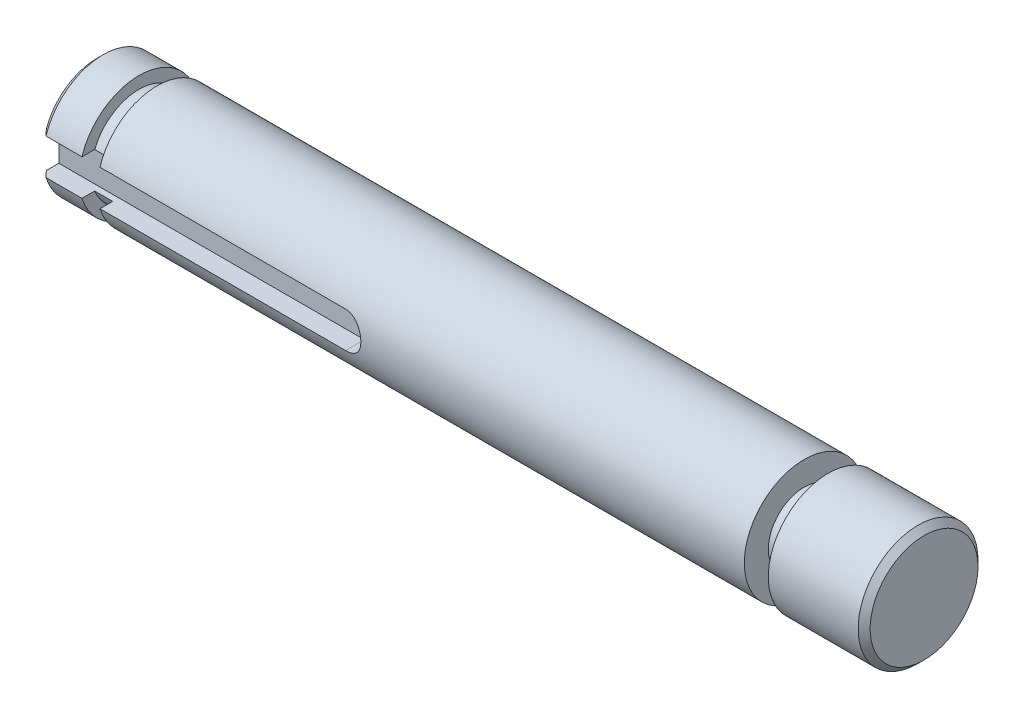
ISO-10303-21;
HEADER;
FILE_DESCRIPTION(('STEP AP214'),'2;1');
FILE_NAME('part.step','',(''),(''),'','','');
FILE_SCHEMA(('AUTOMOTIVE_DESIGN { 1 0 10303 214 1 1 1 1 }'));
ENDSEC;
DATA;
#1=APPLICATION_CONTEXT('core data for automotive mechanical design processes');
#2=APPLICATION_PROTOCOL_DEFINITION('international standard','automotive_design',2000,#1);
#3=PRODUCT_CONTEXT('',#1,'mechanical');
#4=PRODUCT('Part','Part','',(#3));
#5=PRODUCT_RELATED_PRODUCT_CATEGORY('part','',(#4));
#6=PRODUCT_DEFINITION_FORMATION('','',#4);
#7=PRODUCT_DEFINITION_CONTEXT('part definition',#1,'design');
#8=PRODUCT_DEFINITION('design','',#6,#7);
#9=PRODUCT_DEFINITION_SHAPE('','',#8);
#10=(LENGTH_UNIT() NAMED_UNIT(*) SI_UNIT(.MILLI.,.METRE.));
#11=(NAMED_UNIT(*) PLANE_ANGLE_UNIT() SI_UNIT($,.RADIAN.));
#12=(NAMED_UNIT(*) SI_UNIT($,.STERADIAN.) SOLID_ANGLE_UNIT());
#13=UNCERTAINTY_MEASURE_WITH_UNIT(LENGTH_MEASURE(1.E-05),#10,'distance_accuracy_value','');
#14=(GEOMETRIC_REPRESENTATION_CONTEXT(3) GLOBAL_UNCERTAINTY_ASSIGNED_CONTEXT((#13)) GLOBAL_UNIT_ASSIGNED_CONTEXT((#10,
#11,#12)) REPRESENTATION_CONTEXT('',''));
#15=CARTESIAN_POINT('',(0.,0.,0.));
#16=DIRECTION('',(0.,0.,1.));
#17=DIRECTION('',(1.,0.,0.));
#18=AXIS2_PLACEMENT_3D('',#15,#16,#17);
#19=CARTESIAN_POINT('',(34.5,0.,0.));
#20=DIRECTION('',(-1.,0.,0.));
#21=DIRECTION('',(0.,0.,1.));
#22=AXIS2_PLACEMENT_3D('',#19,#20,#21);
#23=CYLINDRICAL_SURFACE('',#22,5.);
#24=CARTESIAN_POINT('',(24.5,0.,0.));
#25=DIRECTION('',(1.,0.,0.));
#26=DIRECTION('',(0.,0.,-1.));
#27=AXIS2_PLACEMENT_3D('',#24,#25,#26);
#28=CIRCLE('',#27,5.);
#29=CARTESIAN_POINT('',(24.5,0.,-5.));
#30=VERTEX_POINT('',#29);
#31=EDGE_CURVE('E183',#30,#30,#28,.T.);
#32=ORIENTED_EDGE('',*,*,#31,.F.);
#33=EDGE_LOOP('',(#32));
#34=FACE_BOUND('',#33,.T.);
#35=DIRECTION('',(-1.,0.,0.));
#36=VECTOR('',#35,1.);
#37=CARTESIAN_POINT('',(34.5,-1.5,4.76969600708473));
#38=LINE('',#37,#36);
#39=CARTESIAN_POINT('',(-29.5,-1.5,4.76969600708473));
#40=VERTEX_POINT('',#39);
#41=CARTESIAN_POINT('',(-9.00000000000001,-1.5,4.76969600708473));
#42=VERTEX_POINT('',#41);
#43=EDGE_CURVE('E165',#40,#42,#38,.F.);
#44=ORIENTED_EDGE('',*,*,#43,.F.);
#45=CARTESIAN_POINT('',(-29.5,0.,0.));
#46=DIRECTION('',(-1.,0.,0.));
#47=DIRECTION('',(0.,0.,1.));
#48=AXIS2_PLACEMENT_3D('',#45,#46,#47);
#49=CIRCLE('',#48,5.);
#50=CARTESIAN_POINT('',(-29.5,1.5,4.76969600708473));
#51=VERTEX_POINT('',#50);
#52=EDGE_CURVE('E171',#51,#40,#49,.T.);
#53=ORIENTED_EDGE('',*,*,#52,.F.);
#54=DIRECTION('',(-1.,0.,0.));
#55=VECTOR('',#54,1.);
#56=CARTESIAN_POINT('',(34.5,1.5,4.76969600708473));
#57=LINE('',#56,#55);
#58=CARTESIAN_POINT('',(-9.00000000000001,1.5,4.76969600708473));
#59=VERTEX_POINT('',#58);
#60=EDGE_CURVE('E156',#59,#51,#57,.T.);
#61=ORIENTED_EDGE('',*,*,#60,.F.);
#62=CARTESIAN_POINT('',(-9.00000000000001,-1.5,4.76969600708473));
#63=CARTESIAN_POINT('',(-8.95882060709199,-1.50000085357071,4.76969249084934));
#64=CARTESIAN_POINT('',(-8.91766195687388,-1.49830317083428,4.77022997000129));
#65=CARTESIAN_POINT('',(-8.83565883790444,-1.49153785660317,4.77235095109999));
#66=CARTESIAN_POINT('',(-8.79481430060511,-1.48647098275841,4.77393421787376));
#67=CARTESIAN_POINT('',(-8.67340945904534,-1.46630203689311,4.78018490618873));
#68=CARTESIAN_POINT('',(-8.59369360958363,-1.44623120413662,4.78635370384275));
#69=CARTESIAN_POINT('',(-8.43896442161414,-1.39353102315626,4.80195952113208));
#70=CARTESIAN_POINT('',(-8.36394944780192,-1.36090607068203,4.81139539670393));
#71=CARTESIAN_POINT('',(-8.22040331840241,-1.28407841117655,4.83246571212052));
#72=CARTESIAN_POINT('',(-8.15187520027157,-1.23987031651226,4.84410117434933));
#73=CARTESIAN_POINT('',(-8.02113394400295,-1.13964850658326,4.86866835244721));
#74=CARTESIAN_POINT('',(-7.95915633965661,-1.08333433465208,4.88162755412974));
#75=CARTESIAN_POINT('',(-7.84536441610004,-0.961138919873354,4.90714811559049));
#76=CARTESIAN_POINT('',(-7.79355181399695,-0.895256063916348,4.91970940785249));
#77=CARTESIAN_POINT('',(-7.70053622968151,-0.75410992131543,4.94333239727705));
#78=CARTESIAN_POINT('',(-7.65957481970205,-0.678680819336259,4.95435770971354));
#79=CARTESIAN_POINT('',(-7.59101158838185,-0.521621185505775,4.97334469846208));
#80=CARTESIAN_POINT('',(-7.56340632220573,-0.439992259012928,4.98130716463903));
#81=CARTESIAN_POINT('',(-7.52312020089796,-0.275324697874879,4.99307639935002));
#82=CARTESIAN_POINT('',(-7.51003514203026,-0.192393125294255,4.99699549276993));
#83=CARTESIAN_POINT('',(-7.49788265863674,-0.0254235719980831,5.00063202022426));
#84=CARTESIAN_POINT('',(-7.49881258029984,0.0586141962423611,5.00035024971471));
#85=CARTESIAN_POINT('',(-7.514392908759,0.222571599946016,4.99569602566267));
#86=CARTESIAN_POINT('',(-7.52860534497872,0.30253714546464,4.99145415509187));
#87=CARTESIAN_POINT('',(-7.56963163523811,0.458890052102024,4.9795151369998));
#88=CARTESIAN_POINT('',(-7.59644614945594,0.535277225531996,4.97181780846028));
#89=CARTESIAN_POINT('',(-7.66221222164644,0.683347815892215,4.95365214926145));
#90=CARTESIAN_POINT('',(-7.70130164435695,0.754966006044141,4.94315255692525));
#91=CARTESIAN_POINT('',(-7.79039859004832,0.890765529574419,4.92049624651755));
#92=CARTESIAN_POINT('',(-7.84040855947884,0.954945191614594,4.90833915735884));
#93=CARTESIAN_POINT('',(-7.95219198808351,1.07665450541275,4.88311673571409));
#94=CARTESIAN_POINT('',(-8.01434386376075,1.13383351478034,4.87003445449554));
#95=CARTESIAN_POINT('',(-8.14749742342792,1.23706769492487,4.84484215114658));
#96=CARTESIAN_POINT('',(-8.21850168036553,1.28311962013078,4.83273241337565));
#97=CARTESIAN_POINT('',(-8.36828092844929,1.36316407240863,4.81077228795653));
#98=CARTESIAN_POINT('',(-8.44712717959341,1.39703006341134,4.80094596245948));
#99=CARTESIAN_POINT('',(-8.60972450398175,1.45085886004699,4.78495663653201));
#100=CARTESIAN_POINT('',(-8.69346786071438,1.47084293218035,4.77878803475875));
#101=CARTESIAN_POINT('',(-8.81499488907019,1.4890120359008,4.77314032325006));
#102=CARTESIAN_POINT('',(-8.85189073417961,1.49313202989009,4.77185156275267));
#103=CARTESIAN_POINT('',(-8.92585147909953,1.49862355614854,4.77012928611782));
#104=CARTESIAN_POINT('',(-8.96291604966386,1.49999912968269,4.76969451246644));
#105=CARTESIAN_POINT('',(-9.00000000000001,1.5,4.76969600708473));
#106=B_SPLINE_CURVE_WITH_KNOTS('',3,(#62,#63,#64,#65,#66,#67,#68,#69,#70,#71,#72,#73,#74,#75,
#76,#77,#78,#79,#80,#81,#82,#83,#84,#85,#86,#87,#88,#89,#90,#91,#92,#93,#94,#95,#96,#97,#98,#99,
#100,#101,#102,#103,#104,#105),.UNSPECIFIED.,.F.,.F.,(4,2,2,2,2,2,2,2,2,2,2,2,2,2,2,2,2,2,2,2,2,
4),(0.,0.123459071219734,0.246890388853042,0.49291134961521,0.738846245884323,0.984895736828092,
1.23795510798803,1.49105719006936,1.74939356197455,2.00766326783256,2.25854751319802,
2.5093842528947,2.75223130012966,2.99509107067835,3.2407824256273,3.48652887757005,
3.74172568310981,3.99699683536777,4.25484698071527,4.51230123440207,4.62365084745808,
4.73483637253615),.UNSPECIFIED.);
#107=EDGE_CURVE('E11',#42,#59,#106,.T.);
#108=ORIENTED_EDGE('',*,*,#107,.F.);
#109=EDGE_LOOP('',(#44,#53,#61,#108));
#110=FACE_BOUND('',#109,.T.);
#111=ADVANCED_FACE('F41',(#34,#110),#23,.T.);
#112=CARTESIAN_POINT('',(-31.,0.,0.));
#113=DIRECTION('',(-1.,0.,0.));
#114=DIRECTION('',(0.,0.,1.));
#115=AXIS2_PLACEMENT_3D('',#112,#113,#114);
#116=PLANE('',#115);
#117=DIRECTION('',(0.,0.,-1.));
#118=VECTOR('',#117,1.);
#119=CARTESIAN_POINT('',(-31.,-1.5,0.));
#120=LINE('',#119,#118);
#121=CARTESIAN_POINT('',(-31.,-1.5,4.76969600708473));
#122=VERTEX_POINT('',#121);
#123=CARTESIAN_POINT('',(-31.,-1.5,3.70809924354783));
#124=VERTEX_POINT('',#123);
#125=EDGE_CURVE('E160',#122,#124,#120,.T.);
#126=ORIENTED_EDGE('',*,*,#125,.F.);
#127=CARTESIAN_POINT('',(-31.,0.,0.));
#128=DIRECTION('',(-1.,0.,0.));
#129=DIRECTION('',(0.,0.,1.));
#130=AXIS2_PLACEMENT_3D('',#127,#128,#129);
#131=CIRCLE('',#130,5.);
#132=CARTESIAN_POINT('',(-31.,1.5,4.76969600708473));
#133=VERTEX_POINT('',#132);
#134=EDGE_CURVE('E174',#133,#122,#131,.T.);
#135=ORIENTED_EDGE('',*,*,#134,.F.);
#136=DIRECTION('',(0.,0.,1.));
#137=VECTOR('',#136,1.);
#138=CARTESIAN_POINT('',(-31.,1.5,0.));
#139=LINE('',#138,#137);
#140=CARTESIAN_POINT('',(-31.,1.5,3.70809924354783));
#141=VERTEX_POINT('',#140);
#142=EDGE_CURVE('E144',#141,#133,#139,.T.);
#143=ORIENTED_EDGE('',*,*,#142,.F.);
#144=CARTESIAN_POINT('',(-31.,0.,0.));
#145=DIRECTION('',(-1.,0.,0.));
#146=DIRECTION('',(0.,0.,1.));
#147=AXIS2_PLACEMENT_3D('',#144,#145,#146);
#148=CIRCLE('',#147,4.);
#149=EDGE_CURVE('E168',#141,#124,#148,.T.);
#150=ORIENTED_EDGE('',*,*,#149,.T.);
#151=EDGE_LOOP('',(#126,#135,#143,#150));
#152=FACE_BOUND('',#151,.T.);
#153=ADVANCED_FACE('F229',(#152),#116,.F.);
#154=CARTESIAN_POINT('',(-29.5,0.,0.));
#155=DIRECTION('',(-1.,0.,0.));
#156=DIRECTION('',(0.,0.,1.));
#157=AXIS2_PLACEMENT_3D('',#154,#155,#156);
#158=PLANE('',#157);
#159=ORIENTED_EDGE('',*,*,#52,.T.);
#160=DIRECTION('',(0.,0.,-1.));
#161=VECTOR('',#160,1.);
#162=CARTESIAN_POINT('',(-29.5,-1.5,0.));
#163=LINE('',#162,#161);
#164=CARTESIAN_POINT('',(-29.5,-1.5,3.70809924354783));
#165=VERTEX_POINT('',#164);
#166=EDGE_CURVE('E71',#40,#165,#163,.T.);
#167=ORIENTED_EDGE('',*,*,#166,.T.);
#168=CARTESIAN_POINT('',(-29.5,0.,0.));
#169=DIRECTION('',(-1.,0.,0.));
#170=DIRECTION('',(0.,0.,1.));
#171=AXIS2_PLACEMENT_3D('',#168,#169,#170);
#172=CIRCLE('',#171,4.);
#173=CARTESIAN_POINT('',(-29.5,1.5,3.70809924354783));
#174=VERTEX_POINT('',#173);
#175=EDGE_CURVE('E167',#174,#165,#172,.T.);
#176=ORIENTED_EDGE('',*,*,#175,.F.);
#177=DIRECTION('',(0.,0.,1.));
#178=VECTOR('',#177,1.);
#179=CARTESIAN_POINT('',(-29.5,1.5,0.));
#180=LINE('',#179,#178);
#181=EDGE_CURVE('E153',#174,#51,#180,.T.);
#182=ORIENTED_EDGE('',*,*,#181,.T.);
#183=EDGE_LOOP('',(#159,#167,#176,#182));
#184=FACE_BOUND('',#183,.T.);
#185=ADVANCED_FACE('F227',(#184),#158,.T.);
#186=CARTESIAN_POINT('',(-31.,0.,0.));
#187=DIRECTION('',(1.,0.,0.));
#188=DIRECTION('',(0.,0.,-1.));
#189=AXIS2_PLACEMENT_3D('',#186,#187,#188);
#190=CYLINDRICAL_SURFACE('',#189,4.);
#191=DIRECTION('',(1.,0.,0.));
#192=VECTOR('',#191,1.);
#193=CARTESIAN_POINT('',(-31.,-1.5,3.70809924354783));
#194=LINE('',#193,#192);
#195=EDGE_CURVE('E162',#124,#165,#194,.T.);
#196=ORIENTED_EDGE('',*,*,#195,.F.);
#197=ORIENTED_EDGE('',*,*,#149,.F.);
#198=DIRECTION('',(1.,0.,0.));
#199=VECTOR('',#198,1.);
#200=CARTESIAN_POINT('',(-31.,1.5,3.70809924354783));
#201=LINE('',#200,#199);
#202=EDGE_CURVE('E151',#174,#141,#201,.F.);
#203=ORIENTED_EDGE('',*,*,#202,.F.);
#204=ORIENTED_EDGE('',*,*,#175,.T.);
#205=EDGE_LOOP('',(#196,#197,#203,#204));
#206=FACE_BOUND('',#205,.T.);
#207=ADVANCED_FACE('F224',(#206),#190,.T.);
#208=CARTESIAN_POINT('',(-34.5,0.,0.));
#209=DIRECTION('',(1.,0.,0.));
#210=DIRECTION('',(0.,0.,-1.));
#211=AXIS2_PLACEMENT_3D('',#208,#209,#210);
#212=PLANE('',#211);
#213=DIRECTION('',(0.,0.,-1.));
#214=VECTOR('',#213,1.);
#215=CARTESIAN_POINT('',(-34.5,-1.5,5.));
#216=LINE('',#215,#214);
#217=CARTESIAN_POINT('',(-34.5,-1.5,4.24264068711928));
#218=VERTEX_POINT('',#217);
#219=CARTESIAN_POINT('',(-34.5,-1.5,3.2));
#220=VERTEX_POINT('',#219);
#221=EDGE_CURVE('E121',#218,#220,#216,.T.);
#222=ORIENTED_EDGE('',*,*,#221,.T.);
#223=DIRECTION('',(0.,-1.,0.));
#224=VECTOR('',#223,1.);
#225=CARTESIAN_POINT('',(-34.5,1.5,3.2));
#226=LINE('',#225,#224);
#227=CARTESIAN_POINT('',(-34.5,1.5,3.2));
#228=VERTEX_POINT('',#227);
#229=EDGE_CURVE('E129',#228,#220,#226,.T.);
#230=ORIENTED_EDGE('',*,*,#229,.F.);
#231=DIRECTION('',(0.,0.,-1.));
#232=VECTOR('',#231,1.);
#233=CARTESIAN_POINT('',(-34.5,1.5,5.));
#234=LINE('',#233,#232);
#235=CARTESIAN_POINT('',(-34.5,1.5,4.24264068711928));
#236=VERTEX_POINT('',#235);
#237=EDGE_CURVE('E280',#236,#228,#234,.T.);
#238=ORIENTED_EDGE('',*,*,#237,.F.);
#239=CARTESIAN_POINT('',(-34.5,0.,0.));
#240=DIRECTION('',(1.,0.,0.));
#241=DIRECTION('',(0.,0.,-1.));
#242=AXIS2_PLACEMENT_3D('',#239,#240,#241);
#243=CIRCLE('',#242,4.5);
#244=EDGE_CURVE('E142',#236,#218,#243,.F.);
#245=ORIENTED_EDGE('',*,*,#244,.T.);
#246=EDGE_LOOP('',(#222,#230,#238,#245));
#247=FACE_BOUND('',#246,.T.);
#248=ADVANCED_FACE('F140',(#247),#212,.F.);
#249=DIRECTION('',(-1.,0.,0.));
#250=VECTOR('',#249,1.);
#251=CARTESIAN_POINT('',(34.5,-1.5,4.76969600708473));
#252=LINE('',#251,#250);
#253=CARTESIAN_POINT('',(-34.,-1.5,4.76969600708473));
#254=VERTEX_POINT('',#253);
#255=EDGE_CURVE('E158',#254,#122,#252,.F.);
#256=ORIENTED_EDGE('',*,*,#255,.F.);
#257=CARTESIAN_POINT('',(-34.,0.,0.));
#258=DIRECTION('',(1.,0.,0.));
#259=DIRECTION('',(0.,0.,-1.));
#260=AXIS2_PLACEMENT_3D('',#257,#258,#259);
#261=CIRCLE('',#260,5.);
#262=CARTESIAN_POINT('',(-34.,1.5,4.76969600708473));
#263=VERTEX_POINT('',#262);
#264=EDGE_CURVE('E197',#254,#263,#261,.T.);
#265=ORIENTED_EDGE('',*,*,#264,.T.);
#266=DIRECTION('',(-1.,0.,0.));
#267=VECTOR('',#266,1.);
#268=CARTESIAN_POINT('',(34.5,1.5,4.76969600708473));
#269=LINE('',#268,#267);
#270=EDGE_CURVE('E63',#133,#263,#269,.T.);
#271=ORIENTED_EDGE('',*,*,#270,.F.);
#272=ORIENTED_EDGE('',*,*,#134,.T.);
#273=EDGE_LOOP('',(#256,#265,#271,#272));
#274=FACE_BOUND('',#273,.T.);
#275=ADVANCED_FACE('F254',(#274),#23,.T.);
#276=CARTESIAN_POINT('',(-34.,0.,0.));
#277=DIRECTION('',(1.,0.,0.));
#278=DIRECTION('',(0.,0.,-1.));
#279=AXIS2_PLACEMENT_3D('',#276,#277,#278);
#280=CONICAL_SURFACE('',#279,5.,0.78539816339745);
#281=ORIENTED_EDGE('',*,*,#264,.F.);
#282=CARTESIAN_POINT('',(-31.8609473171126,-1.5,6.97969005107261));
#283=CARTESIAN_POINT('',(-32.0690052900893,-1.5,6.76685846964305));
#284=CARTESIAN_POINT('',(-32.2768708615187,-1.5,6.55383788587081));
#285=CARTESIAN_POINT('',(-32.6920123009123,-1.5,6.12725063306096));
#286=CARTESIAN_POINT('',(-32.8992882071887,-1.5,5.91368400129659));
#287=CARTESIAN_POINT('',(-33.3129705368911,-1.5,5.48591440945266));
#288=CARTESIAN_POINT('',(-33.519377340571,-1.5,5.27171181751179));
#289=CARTESIAN_POINT('',(-33.9311150771752,-1.5,4.84224439352638));
#290=CARTESIAN_POINT('',(-34.1364459303664,-1.5,4.62697948499158));
#291=CARTESIAN_POINT('',(-34.5456625222699,-1.5,4.19476087473618));
#292=CARTESIAN_POINT('',(-34.7495470263421,-1.5,3.97780600015098));
#293=CARTESIAN_POINT('',(-35.0534378048551,-1.5,3.65061096884926));
#294=CARTESIAN_POINT('',(-35.1544031148046,-1.5,3.54126204128286));
#295=CARTESIAN_POINT('',(-35.3555012481673,-1.5,3.32179359398855));
#296=CARTESIAN_POINT('',(-35.4556340444719,-1.5,3.21167404938082));
#297=CARTESIAN_POINT('',(-35.6548638106812,-1.5,2.99036108474282));
#298=CARTESIAN_POINT('',(-35.7539600067692,-1.5,2.87916696721389));
#299=CARTESIAN_POINT('',(-35.9506379072296,-1.5,2.6554592565589));
#300=CARTESIAN_POINT('',(-36.0482197474772,-1.5,2.54294578342071));
#301=CARTESIAN_POINT('',(-36.1930149701006,-1.5,2.37277183064053));
#302=CARTESIAN_POINT('',(-36.2410318728437,-1.5,2.31579520626767));
#303=CARTESIAN_POINT('',(-36.336410412246,-1.5,2.20129812592812));
#304=CARTESIAN_POINT('',(-36.3837720671063,-1.5,2.14377768514221));
#305=CARTESIAN_POINT('',(-36.4777140489333,-1.5,2.02807141801446));
#306=CARTESIAN_POINT('',(-36.5242941352244,-1.5,1.96988539566466));
#307=CARTESIAN_POINT('',(-36.6164558953132,-1.5,1.85271977151891));
#308=CARTESIAN_POINT('',(-36.6620374724692,-1.5,1.7937400937922));
#309=CARTESIAN_POINT('',(-36.7070140779739,-1.5,1.73429652557169));
#310=B_SPLINE_CURVE_WITH_KNOTS('',3,(#282,#283,#284,#285,#286,#287,#288,#289,#290,#291,#292,
#293,#294,#295,#296,#297,#298,#299,#300,#301,#302,#303,#304,#305,#306,#307,#308,#309),
.UNSPECIFIED.,.F.,.F.,(4,2,2,2,2,2,2,2,2,2,2,2,2,4),(0.,0.89289983798289,1.78574027241742,
2.67813788006185,3.5706007090967,4.46375081632204,4.91024592323062,5.35675551262279,
5.80357753465277,6.25035923115378,6.47388976350276,6.69741407425855,6.92100599838937,
7.1446194683247),.UNSPECIFIED.);
#311=EDGE_CURVE('E56',#254,#218,#310,.T.);
#312=ORIENTED_EDGE('',*,*,#311,.T.);
#313=ORIENTED_EDGE('',*,*,#244,.F.);
#314=CARTESIAN_POINT('',(-36.7070140779739,1.5,1.73429652557169));
#315=CARTESIAN_POINT('',(-36.6731320660261,1.5,1.77908693888236));
#316=CARTESIAN_POINT('',(-36.638900551902,1.5,1.82361036804484));
#317=CARTESIAN_POINT('',(-36.5698385854765,1.5,1.91218682312016));
#318=CARTESIAN_POINT('',(-36.535008164866,1.5,1.9562398737242));
#319=CARTESIAN_POINT('',(-36.429777402497,1.5,2.0877780850195));
#320=CARTESIAN_POINT('',(-36.3586237662692,1.5,2.17466038152806));
#321=CARTESIAN_POINT('',(-36.2148824831828,1.5,2.34715722091075));
#322=CARTESIAN_POINT('',(-36.142295508272,1.5,2.43277232638573));
#323=CARTESIAN_POINT('',(-35.9960055754008,1.5,2.60305076304625));
#324=CARTESIAN_POINT('',(-35.922302551641,1.5,2.6877140375974));
#325=CARTESIAN_POINT('',(-35.7000248776767,1.5,2.94046166043097));
#326=CARTESIAN_POINT('',(-35.5501783529503,1.5,3.10742612228458));
#327=CARTESIAN_POINT('',(-35.2483420576352,1.5,3.43942871545458));
#328=CARTESIAN_POINT('',(-35.0963520574344,1.5,3.60446663688282));
#329=CARTESIAN_POINT('',(-34.8936868957398,1.5,3.82259025149471));
#330=CARTESIAN_POINT('',(-34.8436588755591,1.5,3.87627856474982));
#331=CARTESIAN_POINT('',(-34.7434647717696,1.5,3.98352350180323));
#332=CARTESIAN_POINT('',(-34.6932986919759,1.5,4.03708012916458));
#333=CARTESIAN_POINT('',(-34.542603266947,1.5,4.19758760920788));
#334=CARTESIAN_POINT('',(-34.4418880268484,1.5,4.30436392171742));
#335=CARTESIAN_POINT('',(-34.1363681367456,1.5,4.62707098042187));
#336=CARTESIAN_POINT('',(-33.9309496354163,1.5,4.84242035233032));
#337=CARTESIAN_POINT('',(-33.5190245458365,1.5,5.27207641108813));
#338=CARTESIAN_POINT('',(-33.3125179511522,1.5,5.48638309175751));
#339=CARTESIAN_POINT('',(-32.898818107301,1.5,5.91416941738405));
#340=CARTESIAN_POINT('',(-32.6916251594587,1.5,6.12764935393667));
#341=CARTESIAN_POINT('',(-32.2766677830417,1.5,6.5540456763219));
#342=CARTESIAN_POINT('',(-32.0689033649537,1.5,6.76696207235696));
#343=CARTESIAN_POINT('',(-31.8609473171126,1.5,6.97969005107261));
#344=B_SPLINE_CURVE_WITH_KNOTS('',3,(#314,#315,#316,#317,#318,#319,#320,#321,#322,#323,#324,
#325,#326,#327,#328,#329,#330,#331,#332,#333,#334,#335,#336,#337,#338,#339,#340,#341,#342,#343),
.UNSPECIFIED.,.F.,.F.,(4,2,2,2,2,2,2,2,2,2,2,2,2,2,4),(0.,0.168481178560409,0.336953469263773,
0.673829854894279,1.01055189600276,1.34729386731285,2.02029767349438,2.69337412875385,
2.91352652434992,3.13367289622909,3.57401537215846,4.46684087004097,5.35967165323347,
6.25215200141002,7.14461607990619),.UNSPECIFIED.);
#345=EDGE_CURVE('E201',#236,#263,#344,.T.);
#346=ORIENTED_EDGE('',*,*,#345,.T.);
#347=EDGE_LOOP('',(#281,#312,#313,#346));
#348=FACE_BOUND('',#347,.T.);
#349=ADVANCED_FACE('F43',(#348),#280,.T.);
#350=CARTESIAN_POINT('',(34.,0.,0.));
#351=DIRECTION('',(1.,0.,0.));
#352=DIRECTION('',(0.,0.,-1.));
#353=AXIS2_PLACEMENT_3D('',#350,#351,#352);
#354=CIRCLE('',#353,5.);
#355=CARTESIAN_POINT('',(34.,0.,-5.));
#356=VERTEX_POINT('',#355);
#357=EDGE_CURVE('E194',#356,#356,#354,.F.);
#358=ORIENTED_EDGE('',*,*,#357,.T.);
#359=EDGE_LOOP('',(#358));
#360=FACE_BOUND('',#359,.T.);
#361=CARTESIAN_POINT('',(26.5,0.,0.));
#362=DIRECTION('',(1.,0.,0.));
#363=DIRECTION('',(0.,0.,-1.));
#364=AXIS2_PLACEMENT_3D('',#361,#362,#363);
#365=CIRCLE('',#364,5.);
#366=CARTESIAN_POINT('',(26.5,0.,-5.));
#367=VERTEX_POINT('',#366);
#368=EDGE_CURVE('E186',#367,#367,#365,.T.);
#369=ORIENTED_EDGE('',*,*,#368,.T.);
#370=EDGE_LOOP('',(#369));
#371=FACE_BOUND('',#370,.T.);
#372=ADVANCED_FACE('F251',(#360,#371),#23,.T.);
#373=CARTESIAN_POINT('',(34.5,0.,0.));
#374=DIRECTION('',(1.,0.,0.));
#375=DIRECTION('',(0.,0.,-1.));
#376=AXIS2_PLACEMENT_3D('',#373,#374,#375);
#377=PLANE('',#376);
#378=CARTESIAN_POINT('',(34.5,0.,0.));
#379=DIRECTION('',(1.,0.,0.));
#380=DIRECTION('',(0.,0.,-1.));
#381=AXIS2_PLACEMENT_3D('',#378,#379,#380);
#382=CIRCLE('',#381,4.50000000000002);
#383=CARTESIAN_POINT('',(34.5,0.,-4.50000000000002));
#384=VERTEX_POINT('',#383);
#385=EDGE_CURVE('E189',#384,#384,#382,.T.);
#386=ORIENTED_EDGE('',*,*,#385,.T.);
#387=EDGE_LOOP('',(#386));
#388=FACE_BOUND('',#387,.T.);
#389=ADVANCED_FACE('F244',(#388),#377,.T.);
#390=CARTESIAN_POINT('',(26.5,0.,0.));
#391=DIRECTION('',(1.,0.,0.));
#392=DIRECTION('',(0.,0.,-1.));
#393=AXIS2_PLACEMENT_3D('',#390,#391,#392);
#394=PLANE('',#393);
#395=ORIENTED_EDGE('',*,*,#368,.F.);
#396=EDGE_LOOP('',(#395));
#397=FACE_BOUND('',#396,.T.);
#398=CARTESIAN_POINT('',(26.5,0.,0.));
#399=DIRECTION('',(1.,0.,0.));
#400=DIRECTION('',(0.,0.,-1.));
#401=AXIS2_PLACEMENT_3D('',#398,#399,#400);
#402=CIRCLE('',#401,3.);
#403=CARTESIAN_POINT('',(26.5,0.,-3.));
#404=VERTEX_POINT('',#403);
#405=EDGE_CURVE('E180',#404,#404,#402,.T.);
#406=ORIENTED_EDGE('',*,*,#405,.T.);
#407=EDGE_LOOP('',(#406));
#408=FACE_BOUND('',#407,.T.);
#409=ADVANCED_FACE('F241',(#397,#408),#394,.F.);
#410=CARTESIAN_POINT('',(24.5,0.,0.));
#411=DIRECTION('',(1.,0.,0.));
#412=DIRECTION('',(0.,0.,-1.));
#413=AXIS2_PLACEMENT_3D('',#410,#411,#412);
#414=PLANE('',#413);
#415=ORIENTED_EDGE('',*,*,#31,.T.);
#416=EDGE_LOOP('',(#415));
#417=FACE_BOUND('',#416,.T.);
#418=CARTESIAN_POINT('',(24.5,0.,0.));
#419=DIRECTION('',(1.,0.,0.));
#420=DIRECTION('',(0.,0.,-1.));
#421=AXIS2_PLACEMENT_3D('',#418,#419,#420);
#422=CIRCLE('',#421,3.);
#423=CARTESIAN_POINT('',(24.5,0.,-3.));
#424=VERTEX_POINT('',#423);
#425=EDGE_CURVE('E177',#424,#424,#422,.T.);
#426=ORIENTED_EDGE('',*,*,#425,.F.);
#427=EDGE_LOOP('',(#426));
#428=FACE_BOUND('',#427,.T.);
#429=ADVANCED_FACE('F239',(#417,#428),#414,.T.);
#430=CARTESIAN_POINT('',(26.5,0.,0.));
#431=DIRECTION('',(-1.,0.,0.));
#432=DIRECTION('',(0.,0.,1.));
#433=AXIS2_PLACEMENT_3D('',#430,#431,#432);
#434=CYLINDRICAL_SURFACE('',#433,3.);
#435=ORIENTED_EDGE('',*,*,#405,.F.);
#436=EDGE_LOOP('',(#435));
#437=FACE_BOUND('',#436,.T.);
#438=ORIENTED_EDGE('',*,*,#425,.T.);
#439=EDGE_LOOP('',(#438));
#440=FACE_BOUND('',#439,.T.);
#441=ADVANCED_FACE('F236',(#437,#440),#434,.T.);
#442=CARTESIAN_POINT('',(34.5,0.,0.));
#443=DIRECTION('',(-1.,0.,0.));
#444=DIRECTION('',(0.,0.,1.));
#445=AXIS2_PLACEMENT_3D('',#442,#443,#444);
#446=CONICAL_SURFACE('',#445,4.50000000000002,0.785398163397443);
#447=ORIENTED_EDGE('',*,*,#357,.F.);
#448=EDGE_LOOP('',(#447));
#449=FACE_BOUND('',#448,.T.);
#450=ORIENTED_EDGE('',*,*,#385,.F.);
#451=EDGE_LOOP('',(#450));
#452=FACE_BOUND('',#451,.T.);
#453=ADVANCED_FACE('F219',(#449,#452),#446,.T.);
#454=CARTESIAN_POINT('',(-9.00000000000001,0.,5.));
#455=DIRECTION('',(0.,0.,-1.));
#456=DIRECTION('',(-1.,0.,0.));
#457=AXIS2_PLACEMENT_3D('',#454,#455,#456);
#458=CYLINDRICAL_SURFACE('',#457,1.5);
#459=DIRECTION('',(0.,0.,-1.));
#460=VECTOR('',#459,1.);
#461=CARTESIAN_POINT('',(-9.00000000000001,-1.5,5.));
#462=LINE('',#461,#460);
#463=CARTESIAN_POINT('',(-9.00000000000001,-1.5,3.2));
#464=VERTEX_POINT('',#463);
#465=EDGE_CURVE('E124',#42,#464,#462,.T.);
#466=ORIENTED_EDGE('',*,*,#465,.F.);
#467=ORIENTED_EDGE('',*,*,#107,.T.);
#468=DIRECTION('',(0.,0.,-1.));
#469=VECTOR('',#468,1.);
#470=CARTESIAN_POINT('',(-9.00000000000001,1.5,5.));
#471=LINE('',#470,#469);
#472=CARTESIAN_POINT('',(-9.00000000000001,1.5,3.2));
#473=VERTEX_POINT('',#472);
#474=EDGE_CURVE('E146',#59,#473,#471,.T.);
#475=ORIENTED_EDGE('',*,*,#474,.T.);
#476=CARTESIAN_POINT('',(-9.00000000000001,0.,3.2));
#477=DIRECTION('',(0.,0.,1.));
#478=DIRECTION('',(1.,0.,0.));
#479=AXIS2_PLACEMENT_3D('',#476,#477,#478);
#480=CIRCLE('',#479,1.5);
#481=EDGE_CURVE('E128',#464,#473,#480,.T.);
#482=ORIENTED_EDGE('',*,*,#481,.F.);
#483=EDGE_LOOP('',(#466,#467,#475,#482));
#484=FACE_BOUND('',#483,.T.);
#485=ADVANCED_FACE('F216',(#484),#458,.F.);
#486=CARTESIAN_POINT('',(-34.5,-1.5,5.));
#487=DIRECTION('',(0.,1.,0.));
#488=DIRECTION('',(0.,0.,1.));
#489=AXIS2_PLACEMENT_3D('',#486,#487,#488);
#490=PLANE('',#489);
#491=ORIENTED_EDGE('',*,*,#43,.T.);
#492=ORIENTED_EDGE('',*,*,#465,.T.);
#493=DIRECTION('',(1.,0.,0.));
#494=VECTOR('',#493,1.);
#495=CARTESIAN_POINT('',(-34.5,-1.5,3.2));
#496=LINE('',#495,#494);
#497=EDGE_CURVE('E117',#220,#464,#496,.T.);
#498=ORIENTED_EDGE('',*,*,#497,.F.);
#499=ORIENTED_EDGE('',*,*,#221,.F.);
#500=ORIENTED_EDGE('',*,*,#311,.F.);
#501=ORIENTED_EDGE('',*,*,#255,.T.);
#502=ORIENTED_EDGE('',*,*,#125,.T.);
#503=ORIENTED_EDGE('',*,*,#195,.T.);
#504=ORIENTED_EDGE('',*,*,#166,.F.);
#505=EDGE_LOOP('',(#491,#492,#498,#499,#500,#501,#502,#503,#504));
#506=FACE_BOUND('',#505,.T.);
#507=ADVANCED_FACE('F119',(#506),#490,.T.);
#508=CARTESIAN_POINT('',(-34.5,1.5,5.));
#509=DIRECTION('',(0.,-1.,0.));
#510=DIRECTION('',(0.,0.,-1.));
#511=AXIS2_PLACEMENT_3D('',#508,#509,#510);
#512=PLANE('',#511);
#513=ORIENTED_EDGE('',*,*,#60,.T.);
#514=ORIENTED_EDGE('',*,*,#181,.F.);
#515=ORIENTED_EDGE('',*,*,#202,.T.);
#516=ORIENTED_EDGE('',*,*,#142,.T.);
#517=ORIENTED_EDGE('',*,*,#270,.T.);
#518=ORIENTED_EDGE('',*,*,#345,.F.);
#519=ORIENTED_EDGE('',*,*,#237,.T.);
#520=DIRECTION('',(-1.,0.,0.));
#521=VECTOR('',#520,1.);
#522=CARTESIAN_POINT('',(-34.5,1.5,3.2));
#523=LINE('',#522,#521);
#524=EDGE_CURVE('E135',#473,#228,#523,.T.);
#525=ORIENTED_EDGE('',*,*,#524,.F.);
#526=ORIENTED_EDGE('',*,*,#474,.F.);
#527=EDGE_LOOP('',(#513,#514,#515,#516,#517,#518,#519,#525,#526));
#528=FACE_BOUND('',#527,.T.);
#529=ADVANCED_FACE('F212',(#528),#512,.T.);
#530=CARTESIAN_POINT('',(-9.00000000000001,0.,3.2));
#531=DIRECTION('',(0.,0.,1.));
#532=DIRECTION('',(1.,0.,0.));
#533=AXIS2_PLACEMENT_3D('',#530,#531,#532);
#534=PLANE('',#533);
#535=ORIENTED_EDGE('',*,*,#229,.T.);
#536=ORIENTED_EDGE('',*,*,#497,.T.);
#537=ORIENTED_EDGE('',*,*,#481,.T.);
#538=ORIENTED_EDGE('',*,*,#524,.T.);
#539=EDGE_LOOP('',(#535,#536,#537,#538));
#540=FACE_BOUND('',#539,.T.);
#541=ADVANCED_FACE('F133',(#540),#534,.T.);
#542=CLOSED_SHELL('',(#111,#153,#185,#207,#248,#275,#349,#372,#389,#409,#429,#441,#453,#485,
#507,#529,#541));
#543=MANIFOLD_SOLID_BREP('B2',#542);
#544=ADVANCED_BREP_SHAPE_REPRESENTATION('',(#18,#543),#14);
#545=SHAPE_DEFINITION_REPRESENTATION(#9,#544);
ENDSEC;
END-ISO-10303-21;
